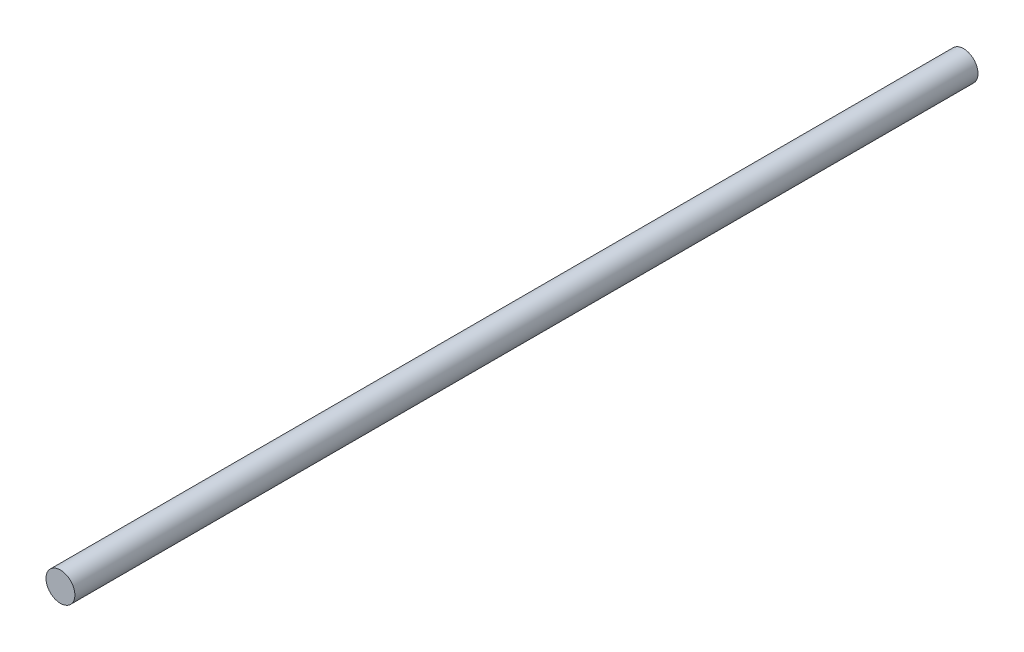
ISO-10303-21;
HEADER;
FILE_DESCRIPTION(('STEP AP214'),'2;1');
FILE_NAME('part.step','',(''),(''),'','','');
FILE_SCHEMA(('AUTOMOTIVE_DESIGN { 1 0 10303 214 1 1 1 1 }'));
ENDSEC;
DATA;
#1=APPLICATION_CONTEXT('core data for automotive mechanical design processes');
#2=APPLICATION_PROTOCOL_DEFINITION('international standard','automotive_design',2000,#1);
#3=PRODUCT_CONTEXT('',#1,'mechanical');
#4=PRODUCT('Part','Part','',(#3));
#5=PRODUCT_RELATED_PRODUCT_CATEGORY('part','',(#4));
#6=PRODUCT_DEFINITION_FORMATION('','',#4);
#7=PRODUCT_DEFINITION_CONTEXT('part definition',#1,'design');
#8=PRODUCT_DEFINITION('design','',#6,#7);
#9=PRODUCT_DEFINITION_SHAPE('','',#8);
#10=(LENGTH_UNIT() NAMED_UNIT(*) SI_UNIT(.MILLI.,.METRE.));
#11=(NAMED_UNIT(*) PLANE_ANGLE_UNIT() SI_UNIT($,.RADIAN.));
#12=(NAMED_UNIT(*) SI_UNIT($,.STERADIAN.) SOLID_ANGLE_UNIT());
#13=UNCERTAINTY_MEASURE_WITH_UNIT(LENGTH_MEASURE(1.E-05),#10,'distance_accuracy_value','');
#14=(GEOMETRIC_REPRESENTATION_CONTEXT(3) GLOBAL_UNCERTAINTY_ASSIGNED_CONTEXT((#13)) GLOBAL_UNIT_ASSIGNED_CONTEXT((#10,
#11,#12)) REPRESENTATION_CONTEXT('',''));
#15=CARTESIAN_POINT('',(0.,0.,0.));
#16=DIRECTION('',(0.,0.,1.));
#17=DIRECTION('',(1.,0.,0.));
#18=AXIS2_PLACEMENT_3D('',#15,#16,#17);
#19=CARTESIAN_POINT('',(0.,0.,-63.5));
#20=DIRECTION('',(0.,0.,1.));
#21=DIRECTION('',(1.,0.,0.));
#22=AXIS2_PLACEMENT_3D('',#19,#20,#21);
#23=CYLINDRICAL_SURFACE('',#22,1.016);
#24=CARTESIAN_POINT('',(0.,0.,-63.5));
#25=DIRECTION('',(0.,0.,1.));
#26=DIRECTION('',(1.,0.,0.));
#27=AXIS2_PLACEMENT_3D('',#24,#25,#26);
#28=CIRCLE('',#27,1.016);
#29=CARTESIAN_POINT('',(1.016,0.,-63.5));
#30=VERTEX_POINT('',#29);
#31=EDGE_CURVE('E10',#30,#30,#28,.T.);
#32=ORIENTED_EDGE('',*,*,#31,.T.);
#33=EDGE_LOOP('',(#32));
#34=FACE_BOUND('',#33,.T.);
#35=CARTESIAN_POINT('',(0.,0.,0.));
#36=DIRECTION('',(0.,0.,1.));
#37=DIRECTION('',(1.,0.,0.));
#38=AXIS2_PLACEMENT_3D('',#35,#36,#37);
#39=CIRCLE('',#38,1.016);
#40=CARTESIAN_POINT('',(1.016,0.,0.));
#41=VERTEX_POINT('',#40);
#42=EDGE_CURVE('E38',#41,#41,#39,.T.);
#43=ORIENTED_EDGE('',*,*,#42,.F.);
#44=EDGE_LOOP('',(#43));
#45=FACE_BOUND('',#44,.T.);
#46=ADVANCED_FACE('F35',(#34,#45),#23,.T.);
#47=CARTESIAN_POINT('',(0.,0.,-63.5));
#48=DIRECTION('',(0.,0.,1.));
#49=DIRECTION('',(1.,0.,0.));
#50=AXIS2_PLACEMENT_3D('',#47,#48,#49);
#51=PLANE('',#50);
#52=ORIENTED_EDGE('',*,*,#31,.F.);
#53=EDGE_LOOP('',(#52));
#54=FACE_BOUND('',#53,.T.);
#55=ADVANCED_FACE('F50',(#54),#51,.F.);
#56=CARTESIAN_POINT('',(0.,0.,0.));
#57=DIRECTION('',(0.,0.,1.));
#58=DIRECTION('',(1.,0.,0.));
#59=AXIS2_PLACEMENT_3D('',#56,#57,#58);
#60=PLANE('',#59);
#61=ORIENTED_EDGE('',*,*,#42,.T.);
#62=EDGE_LOOP('',(#61));
#63=FACE_BOUND('',#62,.T.);
#64=ADVANCED_FACE('F47',(#63),#60,.T.);
#65=CLOSED_SHELL('',(#46,#55,#64));
#66=MANIFOLD_SOLID_BREP('B2',#65);
#67=ADVANCED_BREP_SHAPE_REPRESENTATION('',(#18,#66),#14);
#68=SHAPE_DEFINITION_REPRESENTATION(#9,#67);
ENDSEC;
END-ISO-10303-21;
